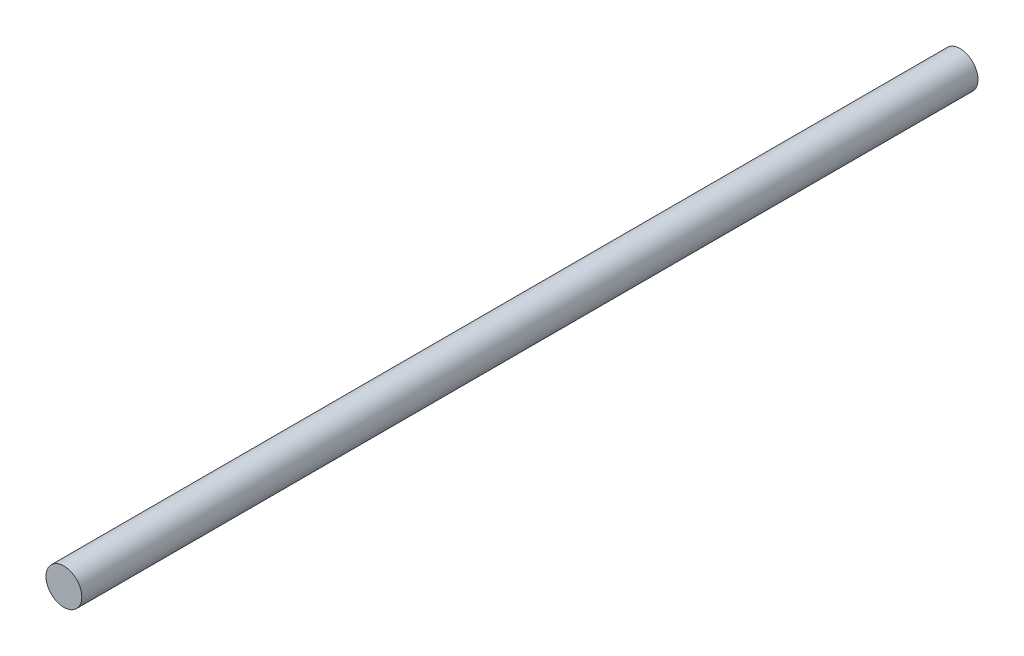
ISO-10303-21;
HEADER;
FILE_DESCRIPTION(('STEP AP214'),'2;1');
FILE_NAME('part.step','',(''),(''),'','','');
FILE_SCHEMA(('AUTOMOTIVE_DESIGN { 1 0 10303 214 1 1 1 1 }'));
ENDSEC;
DATA;
#1=APPLICATION_CONTEXT('core data for automotive mechanical design processes');
#2=APPLICATION_PROTOCOL_DEFINITION('international standard','automotive_design',2000,#1);
#3=PRODUCT_CONTEXT('',#1,'mechanical');
#4=PRODUCT('Part','Part','',(#3));
#5=PRODUCT_RELATED_PRODUCT_CATEGORY('part','',(#4));
#6=PRODUCT_DEFINITION_FORMATION('','',#4);
#7=PRODUCT_DEFINITION_CONTEXT('part definition',#1,'design');
#8=PRODUCT_DEFINITION('design','',#6,#7);
#9=PRODUCT_DEFINITION_SHAPE('','',#8);
#10=(LENGTH_UNIT() NAMED_UNIT(*) SI_UNIT(.MILLI.,.METRE.));
#11=(NAMED_UNIT(*) PLANE_ANGLE_UNIT() SI_UNIT($,.RADIAN.));
#12=(NAMED_UNIT(*) SI_UNIT($,.STERADIAN.) SOLID_ANGLE_UNIT());
#13=UNCERTAINTY_MEASURE_WITH_UNIT(LENGTH_MEASURE(1.E-05),#10,'distance_accuracy_value','');
#14=(GEOMETRIC_REPRESENTATION_CONTEXT(3) GLOBAL_UNCERTAINTY_ASSIGNED_CONTEXT((#13)) GLOBAL_UNIT_ASSIGNED_CONTEXT((#10,
#11,#12)) REPRESENTATION_CONTEXT('',''));
#15=CARTESIAN_POINT('',(0.,0.,0.));
#16=DIRECTION('',(0.,0.,1.));
#17=DIRECTION('',(1.,0.,0.));
#18=AXIS2_PLACEMENT_3D('',#15,#16,#17);
#19=CARTESIAN_POINT('',(1.3,7.00000000000402,-16.2));
#20=DIRECTION('',(0.,0.,1.));
#21=DIRECTION('',(1.,0.,0.));
#22=AXIS2_PLACEMENT_3D('',#19,#20,#21);
#23=PLANE('',#22);
#24=CARTESIAN_POINT('',(1.3,7.00000000000402,-16.2));
#25=DIRECTION('',(0.,0.,1.));
#26=DIRECTION('',(-1.,0.,0.));
#27=AXIS2_PLACEMENT_3D('',#24,#25,#26);
#28=CIRCLE('',#27,0.6);
#29=CARTESIAN_POINT('',(1.9,7.00000000000402,-16.2));
#30=VERTEX_POINT('',#29);
#31=EDGE_CURVE('E11',#30,#30,#28,.T.);
#32=ORIENTED_EDGE('',*,*,#31,.F.);
#33=EDGE_LOOP('',(#32));
#34=FACE_BOUND('',#33,.T.);
#35=ADVANCED_FACE('F16',(#34),#23,.F.);
#36=CARTESIAN_POINT('',(1.3,7.00000000000402,13.8));
#37=DIRECTION('',(0.,0.,1.));
#38=DIRECTION('',(1.,0.,0.));
#39=AXIS2_PLACEMENT_3D('',#36,#37,#38);
#40=PLANE('',#39);
#41=CARTESIAN_POINT('',(1.3,7.00000000000402,13.8));
#42=DIRECTION('',(0.,0.,1.));
#43=DIRECTION('',(-1.,0.,0.));
#44=AXIS2_PLACEMENT_3D('',#41,#42,#43);
#45=CIRCLE('',#44,0.6);
#46=CARTESIAN_POINT('',(1.9,7.00000000000402,13.8));
#47=VERTEX_POINT('',#46);
#48=EDGE_CURVE('E41',#47,#47,#45,.T.);
#49=ORIENTED_EDGE('',*,*,#48,.T.);
#50=EDGE_LOOP('',(#49));
#51=FACE_BOUND('',#50,.T.);
#52=ADVANCED_FACE('F18',(#51),#40,.T.);
#53=CARTESIAN_POINT('',(1.3,7.00000000000402,-16.2));
#54=DIRECTION('',(0.,0.,1.));
#55=DIRECTION('',(-1.,0.,0.));
#56=AXIS2_PLACEMENT_3D('',#53,#54,#55);
#57=CYLINDRICAL_SURFACE('',#56,0.6);
#58=ORIENTED_EDGE('',*,*,#48,.F.);
#59=DIRECTION('',(0.,0.,-1.));
#60=VECTOR('',#59,1.);
#61=CARTESIAN_POINT('',(1.9,7.00000000000402,-16.2));
#62=LINE('',#61,#60);
#63=EDGE_CURVE('E26',#47,#30,#62,.T.);
#64=ORIENTED_EDGE('',*,*,#63,.T.);
#65=ORIENTED_EDGE('',*,*,#31,.T.);
#66=ORIENTED_EDGE('',*,*,#63,.F.);
#67=EDGE_LOOP('',(#58,#64,#65,#66));
#68=FACE_BOUND('',#67,.T.);
#69=ADVANCED_FACE('F40',(#68),#57,.T.);
#70=CLOSED_SHELL('',(#35,#52,#69));
#71=MANIFOLD_SOLID_BREP('B1',#70);
#72=ADVANCED_BREP_SHAPE_REPRESENTATION('',(#18,#71),#14);
#73=SHAPE_DEFINITION_REPRESENTATION(#9,#72);
ENDSEC;
END-ISO-10303-21;
